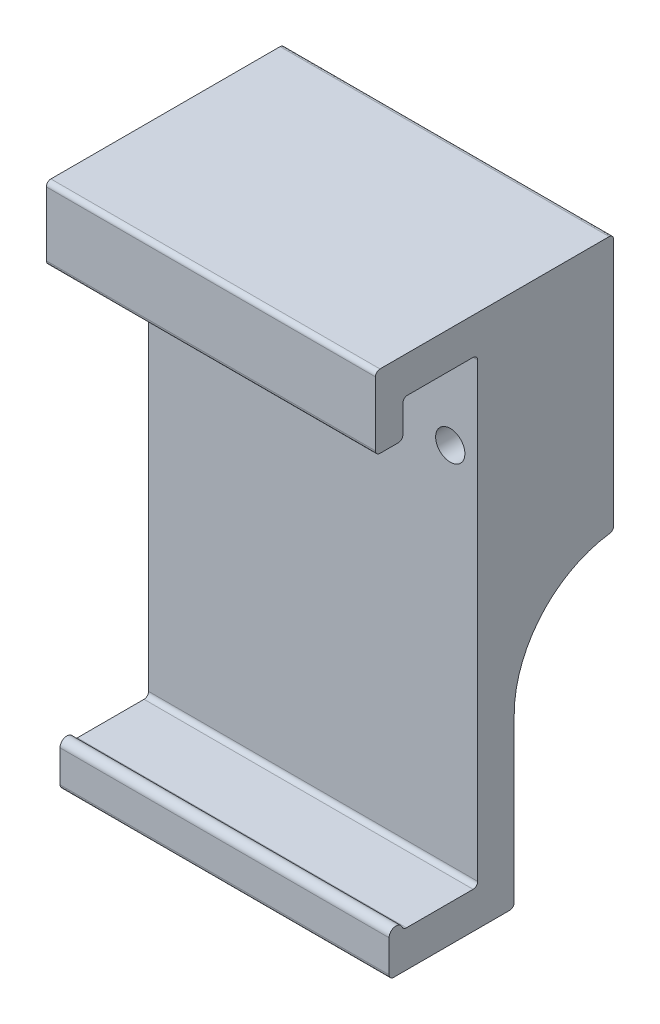
ISO-10303-21;
HEADER;
FILE_DESCRIPTION(('STEP AP214'),'2;1');
FILE_NAME('part.step','',(''),(''),'','','');
FILE_SCHEMA(('AUTOMOTIVE_DESIGN { 1 0 10303 214 1 1 1 1 }'));
ENDSEC;
DATA;
#1=APPLICATION_CONTEXT('core data for automotive mechanical design processes');
#2=APPLICATION_PROTOCOL_DEFINITION('international standard','automotive_design',2000,#1);
#3=PRODUCT_CONTEXT('',#1,'mechanical');
#4=PRODUCT('Part','Part','',(#3));
#5=PRODUCT_RELATED_PRODUCT_CATEGORY('part','',(#4));
#6=PRODUCT_DEFINITION_FORMATION('','',#4);
#7=PRODUCT_DEFINITION_CONTEXT('part definition',#1,'design');
#8=PRODUCT_DEFINITION('design','',#6,#7);
#9=PRODUCT_DEFINITION_SHAPE('','',#8);
#10=(LENGTH_UNIT() NAMED_UNIT(*) SI_UNIT(.MILLI.,.METRE.));
#11=(NAMED_UNIT(*) PLANE_ANGLE_UNIT() SI_UNIT($,.RADIAN.));
#12=(NAMED_UNIT(*) SI_UNIT($,.STERADIAN.) SOLID_ANGLE_UNIT());
#13=UNCERTAINTY_MEASURE_WITH_UNIT(LENGTH_MEASURE(1.E-05),#10,'distance_accuracy_value','');
#14=(GEOMETRIC_REPRESENTATION_CONTEXT(3) GLOBAL_UNCERTAINTY_ASSIGNED_CONTEXT((#13)) GLOBAL_UNIT_ASSIGNED_CONTEXT((#10,
#11,#12)) REPRESENTATION_CONTEXT('',''));
#15=CARTESIAN_POINT('',(0.,0.,0.));
#16=DIRECTION('',(0.,0.,1.));
#17=DIRECTION('',(1.,0.,0.));
#18=AXIS2_PLACEMENT_3D('',#15,#16,#17);
#19=CARTESIAN_POINT('',(14.2875,23.175,-6.425));
#20=DIRECTION('',(0.,0.,1.));
#21=DIRECTION('',(0.,-1.,0.));
#22=AXIS2_PLACEMENT_3D('',#19,#20,#21);
#23=PLANE('',#22);
#24=DIRECTION('',(0.,1.,0.));
#25=VECTOR('',#24,1.);
#26=CARTESIAN_POINT('',(-14.2875,23.175,-6.425));
#27=LINE('',#26,#25);
#28=CARTESIAN_POINT('',(-14.2875,-22.778125,-6.425));
#29=VERTEX_POINT('',#28);
#30=CARTESIAN_POINT('',(-14.2875,-8.61832244668706,-6.425));
#31=VERTEX_POINT('',#30);
#32=EDGE_CURVE('E261',#29,#31,#27,.T.);
#33=ORIENTED_EDGE('',*,*,#32,.T.);
#34=DIRECTION('',(-1.,0.,0.));
#35=VECTOR('',#34,1.);
#36=CARTESIAN_POINT('',(14.2875,-8.61832244668706,-6.425));
#37=LINE('',#36,#35);
#38=CARTESIAN_POINT('',(14.2875,-8.61832244668706,-6.425));
#39=VERTEX_POINT('',#38);
#40=EDGE_CURVE('E58',#31,#39,#37,.F.);
#41=ORIENTED_EDGE('',*,*,#40,.T.);
#42=DIRECTION('',(0.,1.,0.));
#43=VECTOR('',#42,1.);
#44=CARTESIAN_POINT('',(14.2875,23.175,-6.425));
#45=LINE('',#44,#43);
#46=CARTESIAN_POINT('',(14.2875,-22.778125,-6.425));
#47=VERTEX_POINT('',#46);
#48=EDGE_CURVE('E230',#47,#39,#45,.T.);
#49=ORIENTED_EDGE('',*,*,#48,.F.);
#50=DIRECTION('',(-1.,0.,0.));
#51=VECTOR('',#50,1.);
#52=CARTESIAN_POINT('',(14.2875,-22.778125,-6.425));
#53=LINE('',#52,#51);
#54=EDGE_CURVE('E374',#47,#29,#53,.T.);
#55=ORIENTED_EDGE('',*,*,#54,.T.);
#56=EDGE_LOOP('',(#33,#41,#49,#55));
#57=FACE_BOUND('',#56,.T.);
#58=ADVANCED_FACE('F37',(#57),#23,.F.);
#59=CARTESIAN_POINT('',(14.2875,20.,-3.25));
#60=DIRECTION('',(0.,0.,-1.));
#61=DIRECTION('',(-1.,0.,0.));
#62=AXIS2_PLACEMENT_3D('',#59,#60,#61);
#63=PLANE('',#62);
#64=CARTESIAN_POINT('',(11.90625,11.999,-3.25));
#65=DIRECTION('',(0.,0.,-1.));
#66=DIRECTION('',(-1.,0.,0.));
#67=AXIS2_PLACEMENT_3D('',#64,#65,#66);
#68=CIRCLE('',#67,1.27);
#69=CARTESIAN_POINT('',(10.63625,11.999,-3.25));
#70=VERTEX_POINT('',#69);
#71=EDGE_CURVE('E396',#70,#70,#68,.T.);
#72=ORIENTED_EDGE('',*,*,#71,.T.);
#73=EDGE_LOOP('',(#72));
#74=FACE_BOUND('',#73,.T.);
#75=CARTESIAN_POINT('',(-11.90625,11.9990000000001,-3.25));
#76=DIRECTION('',(0.,0.,-1.));
#77=DIRECTION('',(-1.,0.,0.));
#78=AXIS2_PLACEMENT_3D('',#75,#76,#77);
#79=CIRCLE('',#78,1.27);
#80=CARTESIAN_POINT('',(-13.17625,11.9990000000001,-3.25));
#81=VERTEX_POINT('',#80);
#82=EDGE_CURVE('E400',#81,#81,#79,.T.);
#83=ORIENTED_EDGE('',*,*,#82,.T.);
#84=EDGE_LOOP('',(#83));
#85=FACE_BOUND('',#84,.T.);
#86=DIRECTION('',(0.,-1.,0.));
#87=VECTOR('',#86,1.);
#88=CARTESIAN_POINT('',(14.2875,20.,-3.25));
#89=LINE('',#88,#87);
#90=CARTESIAN_POINT('',(14.2875,19.603125,-3.25));
#91=VERTEX_POINT('',#90);
#92=CARTESIAN_POINT('',(14.2875,-19.603125,-3.25));
#93=VERTEX_POINT('',#92);
#94=EDGE_CURVE('E276',#91,#93,#89,.T.);
#95=ORIENTED_EDGE('',*,*,#94,.F.);
#96=DIRECTION('',(-1.,0.,0.));
#97=VECTOR('',#96,1.);
#98=CARTESIAN_POINT('',(-14.2875,19.603125,-3.25));
#99=LINE('',#98,#97);
#100=CARTESIAN_POINT('',(-14.2875,19.603125,-3.25));
#101=VERTEX_POINT('',#100);
#102=EDGE_CURVE('E318',#91,#101,#99,.T.);
#103=ORIENTED_EDGE('',*,*,#102,.T.);
#104=DIRECTION('',(0.,-1.,0.));
#105=VECTOR('',#104,1.);
#106=CARTESIAN_POINT('',(-14.2875,20.,-3.25));
#107=LINE('',#106,#105);
#108=CARTESIAN_POINT('',(-14.2875,-19.603125,-3.25));
#109=VERTEX_POINT('',#108);
#110=EDGE_CURVE('E248',#101,#109,#107,.T.);
#111=ORIENTED_EDGE('',*,*,#110,.T.);
#112=DIRECTION('',(-1.,0.,0.));
#113=VECTOR('',#112,1.);
#114=CARTESIAN_POINT('',(14.2875,-19.603125,-3.25));
#115=LINE('',#114,#113);
#116=EDGE_CURVE('E316',#109,#93,#115,.F.);
#117=ORIENTED_EDGE('',*,*,#116,.T.);
#118=EDGE_LOOP('',(#95,#103,#111,#117));
#119=FACE_BOUND('',#118,.T.);
#120=ADVANCED_FACE('F476',(#74,#85,#119),#63,.F.);
#121=CARTESIAN_POINT('',(14.2875,-20.,-3.25));
#122=DIRECTION('',(0.,-1.,0.));
#123=DIRECTION('',(0.,0.,-1.));
#124=AXIS2_PLACEMENT_3D('',#121,#122,#123);
#125=PLANE('',#124);
#126=DIRECTION('',(0.,0.,1.));
#127=VECTOR('',#126,1.);
#128=CARTESIAN_POINT('',(14.2875,-20.,-3.25));
#129=LINE('',#128,#127);
#130=CARTESIAN_POINT('',(14.2875,-20.,-2.853125));
#131=VERTEX_POINT('',#130);
#132=CARTESIAN_POINT('',(14.2875,-20.,2.9359576355322));
#133=VERTEX_POINT('',#132);
#134=EDGE_CURVE('E211',#131,#133,#129,.T.);
#135=ORIENTED_EDGE('',*,*,#134,.F.);
#136=DIRECTION('',(-1.,0.,0.));
#137=VECTOR('',#136,1.);
#138=CARTESIAN_POINT('',(-14.2875,-20.,-2.853125));
#139=LINE('',#138,#137);
#140=CARTESIAN_POINT('',(-14.2875,-20.,-2.853125));
#141=VERTEX_POINT('',#140);
#142=EDGE_CURVE('E328',#131,#141,#139,.T.);
#143=ORIENTED_EDGE('',*,*,#142,.T.);
#144=DIRECTION('',(0.,0.,1.));
#145=VECTOR('',#144,1.);
#146=CARTESIAN_POINT('',(-14.2875,-20.,-3.25));
#147=LINE('',#146,#145);
#148=CARTESIAN_POINT('',(-14.2875,-20.,2.9359576355322));
#149=VERTEX_POINT('',#148);
#150=EDGE_CURVE('E251',#141,#149,#147,.T.);
#151=ORIENTED_EDGE('',*,*,#150,.T.);
#152=DIRECTION('',(1.,0.,0.));
#153=VECTOR('',#152,1.);
#154=CARTESIAN_POINT('',(14.2875,-20.,2.9359576355322));
#155=LINE('',#154,#153);
#156=EDGE_CURVE('E326',#149,#133,#155,.T.);
#157=ORIENTED_EDGE('',*,*,#156,.T.);
#158=EDGE_LOOP('',(#135,#143,#151,#157));
#159=FACE_BOUND('',#158,.T.);
#160=ADVANCED_FACE('F481',(#159),#125,.F.);
#161=CARTESIAN_POINT('',(14.2875,-20.,3.8453125));
#162=DIRECTION('',(-1.,0.,0.));
#163=DIRECTION('',(0.,0.,1.));
#164=AXIS2_PLACEMENT_3D('',#161,#162,#163);
#165=CYLINDRICAL_SURFACE('',#164,0.595312500000001);
#166=CARTESIAN_POINT('',(14.2875,-20.,3.8453125));
#167=DIRECTION('',(1.,0.,0.));
#168=DIRECTION('',(0.,0.,-1.));
#169=AXIS2_PLACEMENT_3D('',#166,#167,#168);
#170=CIRCLE('',#169,0.595312500000001);
#171=CARTESIAN_POINT('',(14.2875,-19.761875,3.29969958131932));
#172=VERTEX_POINT('',#171);
#173=CARTESIAN_POINT('',(14.2875,-20.,4.440625));
#174=VERTEX_POINT('',#173);
#175=EDGE_CURVE('E198',#172,#174,#170,.T.);
#176=ORIENTED_EDGE('',*,*,#175,.F.);
#177=DIRECTION('',(-1.,0.,0.));
#178=VECTOR('',#177,1.);
#179=CARTESIAN_POINT('',(14.2875,-19.761875,3.29969958131932));
#180=LINE('',#179,#178);
#181=CARTESIAN_POINT('',(-14.2875,-19.761875,3.29969958131932));
#182=VERTEX_POINT('',#181);
#183=EDGE_CURVE('E331',#172,#182,#180,.T.);
#184=ORIENTED_EDGE('',*,*,#183,.T.);
#185=CARTESIAN_POINT('',(-14.2875,-20.,3.8453125));
#186=DIRECTION('',(1.,0.,0.));
#187=DIRECTION('',(0.,0.,-1.));
#188=AXIS2_PLACEMENT_3D('',#185,#186,#187);
#189=CIRCLE('',#188,0.595312500000001);
#190=CARTESIAN_POINT('',(-14.2875,-20.,4.440625));
#191=VERTEX_POINT('',#190);
#192=EDGE_CURVE('E217',#182,#191,#189,.T.);
#193=ORIENTED_EDGE('',*,*,#192,.T.);
#194=DIRECTION('',(-1.,0.,0.));
#195=VECTOR('',#194,1.);
#196=CARTESIAN_POINT('',(14.2875,-20.,4.440625));
#197=LINE('',#196,#195);
#198=EDGE_CURVE('E214',#174,#191,#197,.T.);
#199=ORIENTED_EDGE('',*,*,#198,.F.);
#200=EDGE_LOOP('',(#176,#184,#193,#199));
#201=FACE_BOUND('',#200,.T.);
#202=ADVANCED_FACE('F215',(#201),#165,.T.);
#203=CARTESIAN_POINT('',(14.2875,-23.175,4.440625));
#204=DIRECTION('',(0.,0.,-1.));
#205=DIRECTION('',(0.,1.,0.));
#206=AXIS2_PLACEMENT_3D('',#203,#204,#205);
#207=PLANE('',#206);
#208=DIRECTION('',(0.,-1.,0.));
#209=VECTOR('',#208,1.);
#210=CARTESIAN_POINT('',(-14.2875,-23.175,4.440625));
#211=LINE('',#210,#209);
#212=CARTESIAN_POINT('',(-14.2875,-22.778125,4.440625));
#213=VERTEX_POINT('',#212);
#214=EDGE_CURVE('E256',#191,#213,#211,.T.);
#215=ORIENTED_EDGE('',*,*,#214,.T.);
#216=DIRECTION('',(-1.,0.,0.));
#217=VECTOR('',#216,1.);
#218=CARTESIAN_POINT('',(14.2875,-22.778125,4.440625));
#219=LINE('',#218,#217);
#220=CARTESIAN_POINT('',(14.2875,-22.778125,4.440625));
#221=VERTEX_POINT('',#220);
#222=EDGE_CURVE('E226',#213,#221,#219,.F.);
#223=ORIENTED_EDGE('',*,*,#222,.T.);
#224=DIRECTION('',(0.,-1.,0.));
#225=VECTOR('',#224,1.);
#226=CARTESIAN_POINT('',(14.2875,-23.175,4.440625));
#227=LINE('',#226,#225);
#228=EDGE_CURVE('E203',#174,#221,#227,.T.);
#229=ORIENTED_EDGE('',*,*,#228,.F.);
#230=ORIENTED_EDGE('',*,*,#198,.T.);
#231=EDGE_LOOP('',(#215,#223,#229,#230));
#232=FACE_BOUND('',#231,.T.);
#233=ADVANCED_FACE('F224',(#232),#207,.F.);
#234=CARTESIAN_POINT('',(14.2875,-23.175,-6.425));
#235=DIRECTION('',(0.,1.,0.));
#236=DIRECTION('',(0.,0.,1.));
#237=AXIS2_PLACEMENT_3D('',#234,#235,#236);
#238=PLANE('',#237);
#239=DIRECTION('',(0.,0.,-1.));
#240=VECTOR('',#239,1.);
#241=CARTESIAN_POINT('',(-14.2875,-23.175,-6.425));
#242=LINE('',#241,#240);
#243=CARTESIAN_POINT('',(-14.2875,-23.175,4.04375));
#244=VERTEX_POINT('',#243);
#245=CARTESIAN_POINT('',(-14.2875,-23.175,-6.028125));
#246=VERTEX_POINT('',#245);
#247=EDGE_CURVE('E258',#244,#246,#242,.T.);
#248=ORIENTED_EDGE('',*,*,#247,.T.);
#249=DIRECTION('',(-1.,0.,0.));
#250=VECTOR('',#249,1.);
#251=CARTESIAN_POINT('',(14.2875,-23.175,-6.028125));
#252=LINE('',#251,#250);
#253=CARTESIAN_POINT('',(14.2875,-23.175,-6.028125));
#254=VERTEX_POINT('',#253);
#255=EDGE_CURVE('E377',#246,#254,#252,.F.);
#256=ORIENTED_EDGE('',*,*,#255,.T.);
#257=DIRECTION('',(0.,0.,-1.));
#258=VECTOR('',#257,1.);
#259=CARTESIAN_POINT('',(14.2875,-23.175,-6.425));
#260=LINE('',#259,#258);
#261=CARTESIAN_POINT('',(14.2875,-23.175,4.04375));
#262=VERTEX_POINT('',#261);
#263=EDGE_CURVE('E227',#262,#254,#260,.T.);
#264=ORIENTED_EDGE('',*,*,#263,.F.);
#265=DIRECTION('',(-1.,0.,0.));
#266=VECTOR('',#265,1.);
#267=CARTESIAN_POINT('',(14.2875,-23.175,4.04375));
#268=LINE('',#267,#266);
#269=EDGE_CURVE('E312',#262,#244,#268,.T.);
#270=ORIENTED_EDGE('',*,*,#269,.T.);
#271=EDGE_LOOP('',(#248,#256,#264,#270));
#272=FACE_BOUND('',#271,.T.);
#273=ADVANCED_FACE('F419',(#272),#238,.F.);
#274=CARTESIAN_POINT('',(14.2875,23.175,5.63125));
#275=DIRECTION('',(0.,-1.,0.));
#276=DIRECTION('',(0.,0.,-1.));
#277=AXIS2_PLACEMENT_3D('',#274,#275,#276);
#278=PLANE('',#277);
#279=DIRECTION('',(0.,0.,1.));
#280=VECTOR('',#279,1.);
#281=CARTESIAN_POINT('',(14.2875,23.175,5.63125));
#282=LINE('',#281,#280);
#283=CARTESIAN_POINT('',(14.2875,23.175,-14.664125));
#284=VERTEX_POINT('',#283);
#285=CARTESIAN_POINT('',(14.2875,23.175,5.234375));
#286=VERTEX_POINT('',#285);
#287=EDGE_CURVE('E235',#284,#286,#282,.T.);
#288=ORIENTED_EDGE('',*,*,#287,.F.);
#289=DIRECTION('',(-1.,0.,0.));
#290=VECTOR('',#289,1.);
#291=CARTESIAN_POINT('',(14.2875,23.175,-14.664125));
#292=LINE('',#291,#290);
#293=CARTESIAN_POINT('',(-14.2875,23.175,-14.664125));
#294=VERTEX_POINT('',#293);
#295=EDGE_CURVE('E359',#284,#294,#292,.T.);
#296=ORIENTED_EDGE('',*,*,#295,.T.);
#297=DIRECTION('',(0.,0.,1.));
#298=VECTOR('',#297,1.);
#299=CARTESIAN_POINT('',(-14.2875,23.175,5.63125));
#300=LINE('',#299,#298);
#301=CARTESIAN_POINT('',(-14.2875,23.175,5.234375));
#302=VERTEX_POINT('',#301);
#303=EDGE_CURVE('E263',#294,#302,#300,.T.);
#304=ORIENTED_EDGE('',*,*,#303,.T.);
#305=DIRECTION('',(-1.,0.,0.));
#306=VECTOR('',#305,1.);
#307=CARTESIAN_POINT('',(14.2875,23.175,5.234375));
#308=LINE('',#307,#306);
#309=EDGE_CURVE('E309',#302,#286,#308,.F.);
#310=ORIENTED_EDGE('',*,*,#309,.T.);
#311=EDGE_LOOP('',(#288,#296,#304,#310));
#312=FACE_BOUND('',#311,.T.);
#313=ADVANCED_FACE('F432',(#312),#278,.F.);
#314=CARTESIAN_POINT('',(14.2875,16.825,5.63125));
#315=DIRECTION('',(0.,0.,-1.));
#316=DIRECTION('',(-1.,0.,0.));
#317=AXIS2_PLACEMENT_3D('',#314,#315,#316);
#318=PLANE('',#317);
#319=DIRECTION('',(0.,-1.,0.));
#320=VECTOR('',#319,1.);
#321=CARTESIAN_POINT('',(-14.2875,16.825,5.63125));
#322=LINE('',#321,#320);
#323=CARTESIAN_POINT('',(-14.2875,22.778125,5.63125));
#324=VERTEX_POINT('',#323);
#325=CARTESIAN_POINT('',(-14.2875,17.221875,5.63125));
#326=VERTEX_POINT('',#325);
#327=EDGE_CURVE('E265',#324,#326,#322,.T.);
#328=ORIENTED_EDGE('',*,*,#327,.T.);
#329=DIRECTION('',(-1.,0.,0.));
#330=VECTOR('',#329,1.);
#331=CARTESIAN_POINT('',(14.2875,17.221875,5.63125));
#332=LINE('',#331,#330);
#333=CARTESIAN_POINT('',(14.2875,17.221875,5.63125));
#334=VERTEX_POINT('',#333);
#335=EDGE_CURVE('E307',#326,#334,#332,.F.);
#336=ORIENTED_EDGE('',*,*,#335,.T.);
#337=DIRECTION('',(0.,-1.,0.));
#338=VECTOR('',#337,1.);
#339=CARTESIAN_POINT('',(14.2875,16.825,5.63125));
#340=LINE('',#339,#338);
#341=CARTESIAN_POINT('',(14.2875,22.778125,5.63125));
#342=VERTEX_POINT('',#341);
#343=EDGE_CURVE('E237',#342,#334,#340,.T.);
#344=ORIENTED_EDGE('',*,*,#343,.F.);
#345=DIRECTION('',(-1.,0.,0.));
#346=VECTOR('',#345,1.);
#347=CARTESIAN_POINT('',(14.2875,22.778125,5.63125));
#348=LINE('',#347,#346);
#349=EDGE_CURVE('E304',#342,#324,#348,.T.);
#350=ORIENTED_EDGE('',*,*,#349,.T.);
#351=EDGE_LOOP('',(#328,#336,#344,#350));
#352=FACE_BOUND('',#351,.T.);
#353=ADVANCED_FACE('F441',(#352),#318,.F.);
#354=CARTESIAN_POINT('',(14.2875,16.825,3.25));
#355=DIRECTION('',(0.,1.,0.));
#356=DIRECTION('',(0.,0.,1.));
#357=AXIS2_PLACEMENT_3D('',#354,#355,#356);
#358=PLANE('',#357);
#359=DIRECTION('',(0.,0.,-1.));
#360=VECTOR('',#359,1.);
#361=CARTESIAN_POINT('',(-14.2875,16.825,3.25));
#362=LINE('',#361,#360);
#363=CARTESIAN_POINT('',(-14.2875,16.825,5.234375));
#364=VERTEX_POINT('',#363);
#365=CARTESIAN_POINT('',(-14.2875,16.825,3.646875));
#366=VERTEX_POINT('',#365);
#367=EDGE_CURVE('E268',#364,#366,#362,.T.);
#368=ORIENTED_EDGE('',*,*,#367,.T.);
#369=DIRECTION('',(-1.,0.,0.));
#370=VECTOR('',#369,1.);
#371=CARTESIAN_POINT('',(14.2875,16.825,3.646875));
#372=LINE('',#371,#370);
#373=CARTESIAN_POINT('',(14.2875,16.825,3.646875));
#374=VERTEX_POINT('',#373);
#375=EDGE_CURVE('E294',#366,#374,#372,.F.);
#376=ORIENTED_EDGE('',*,*,#375,.T.);
#377=DIRECTION('',(0.,0.,-1.));
#378=VECTOR('',#377,1.);
#379=CARTESIAN_POINT('',(14.2875,16.825,3.25));
#380=LINE('',#379,#378);
#381=CARTESIAN_POINT('',(14.2875,16.825,5.234375));
#382=VERTEX_POINT('',#381);
#383=EDGE_CURVE('E240',#382,#374,#380,.T.);
#384=ORIENTED_EDGE('',*,*,#383,.F.);
#385=DIRECTION('',(-1.,0.,0.));
#386=VECTOR('',#385,1.);
#387=CARTESIAN_POINT('',(14.2875,16.825,5.234375));
#388=LINE('',#387,#386);
#389=EDGE_CURVE('E291',#382,#364,#388,.T.);
#390=ORIENTED_EDGE('',*,*,#389,.T.);
#391=EDGE_LOOP('',(#368,#376,#384,#390));
#392=FACE_BOUND('',#391,.T.);
#393=ADVANCED_FACE('F450',(#392),#358,.F.);
#394=CARTESIAN_POINT('',(14.2875,16.825,3.25));
#395=DIRECTION('',(0.,0.,1.));
#396=DIRECTION('',(0.,-1.,0.));
#397=AXIS2_PLACEMENT_3D('',#394,#395,#396);
#398=PLANE('',#397);
#399=DIRECTION('',(0.,1.,0.));
#400=VECTOR('',#399,1.);
#401=CARTESIAN_POINT('',(14.2875,16.825,3.25));
#402=LINE('',#401,#400);
#403=CARTESIAN_POINT('',(14.2875,17.221875,3.25));
#404=VERTEX_POINT('',#403);
#405=CARTESIAN_POINT('',(14.2875,19.603125,3.25));
#406=VERTEX_POINT('',#405);
#407=EDGE_CURVE('E243',#404,#406,#402,.T.);
#408=ORIENTED_EDGE('',*,*,#407,.F.);
#409=DIRECTION('',(-1.,0.,0.));
#410=VECTOR('',#409,1.);
#411=CARTESIAN_POINT('',(14.2875,17.221875,3.25));
#412=LINE('',#411,#410);
#413=CARTESIAN_POINT('',(-14.2875,17.221875,3.25));
#414=VERTEX_POINT('',#413);
#415=EDGE_CURVE('E279',#404,#414,#412,.T.);
#416=ORIENTED_EDGE('',*,*,#415,.T.);
#417=DIRECTION('',(0.,1.,0.));
#418=VECTOR('',#417,1.);
#419=CARTESIAN_POINT('',(-14.2875,16.825,3.25));
#420=LINE('',#419,#418);
#421=CARTESIAN_POINT('',(-14.2875,19.603125,3.25));
#422=VERTEX_POINT('',#421);
#423=EDGE_CURVE('E271',#414,#422,#420,.T.);
#424=ORIENTED_EDGE('',*,*,#423,.T.);
#425=DIRECTION('',(-1.,0.,0.));
#426=VECTOR('',#425,1.);
#427=CARTESIAN_POINT('',(14.2875,19.603125,3.25));
#428=LINE('',#427,#426);
#429=EDGE_CURVE('E221',#422,#406,#428,.F.);
#430=ORIENTED_EDGE('',*,*,#429,.T.);
#431=EDGE_LOOP('',(#408,#416,#424,#430));
#432=FACE_BOUND('',#431,.T.);
#433=ADVANCED_FACE('F459',(#432),#398,.F.);
#434=CARTESIAN_POINT('',(14.2875,20.,3.25));
#435=DIRECTION('',(0.,1.,0.));
#436=DIRECTION('',(0.,0.,1.));
#437=AXIS2_PLACEMENT_3D('',#434,#435,#436);
#438=PLANE('',#437);
#439=DIRECTION('',(0.,0.,-1.));
#440=VECTOR('',#439,1.);
#441=CARTESIAN_POINT('',(-14.2875,20.,3.25));
#442=LINE('',#441,#440);
#443=CARTESIAN_POINT('',(-14.2875,20.,2.853125));
#444=VERTEX_POINT('',#443);
#445=CARTESIAN_POINT('',(-14.2875,20.,-2.853125));
#446=VERTEX_POINT('',#445);
#447=EDGE_CURVE('E274',#444,#446,#442,.T.);
#448=ORIENTED_EDGE('',*,*,#447,.T.);
#449=DIRECTION('',(-1.,0.,0.));
#450=VECTOR('',#449,1.);
#451=CARTESIAN_POINT('',(14.2875,20.,-2.853125));
#452=LINE('',#451,#450);
#453=CARTESIAN_POINT('',(14.2875,20.,-2.853125));
#454=VERTEX_POINT('',#453);
#455=EDGE_CURVE('E324',#446,#454,#452,.F.);
#456=ORIENTED_EDGE('',*,*,#455,.T.);
#457=DIRECTION('',(0.,0.,-1.));
#458=VECTOR('',#457,1.);
#459=CARTESIAN_POINT('',(14.2875,20.,3.25));
#460=LINE('',#459,#458);
#461=CARTESIAN_POINT('',(14.2875,20.,2.853125));
#462=VERTEX_POINT('',#461);
#463=EDGE_CURVE('E222',#462,#454,#460,.T.);
#464=ORIENTED_EDGE('',*,*,#463,.F.);
#465=DIRECTION('',(-1.,0.,0.));
#466=VECTOR('',#465,1.);
#467=CARTESIAN_POINT('',(-14.2875,20.,2.853125));
#468=LINE('',#467,#466);
#469=EDGE_CURVE('E321',#462,#444,#468,.T.);
#470=ORIENTED_EDGE('',*,*,#469,.T.);
#471=EDGE_LOOP('',(#448,#456,#464,#470));
#472=FACE_BOUND('',#471,.T.);
#473=ADVANCED_FACE('F468',(#472),#438,.F.);
#474=CARTESIAN_POINT('',(14.2875,-20.,3.8453125));
#475=DIRECTION('',(1.,0.,0.));
#476=DIRECTION('',(0.,0.,-1.));
#477=AXIS2_PLACEMENT_3D('',#474,#475,#476);
#478=PLANE('',#477);
#479=DIRECTION('',(0.,1.,0.));
#480=VECTOR('',#479,1.);
#481=CARTESIAN_POINT('',(14.2875,20.635,-15.061));
#482=LINE('',#481,#480);
#483=CARTESIAN_POINT('',(14.2875,1.21987500000001,-15.061));
#484=VERTEX_POINT('',#483);
#485=CARTESIAN_POINT('',(14.2875,22.778125,-15.061));
#486=VERTEX_POINT('',#485);
#487=EDGE_CURVE('E252',#484,#486,#482,.T.);
#488=ORIENTED_EDGE('',*,*,#487,.T.);
#489=CARTESIAN_POINT('',(14.2875,22.778125,-14.664125));
#490=DIRECTION('',(1.,0.,0.));
#491=DIRECTION('',(0.,0.,-1.));
#492=AXIS2_PLACEMENT_3D('',#489,#490,#491);
#493=CIRCLE('',#492,0.396875);
#494=EDGE_CURVE('E372',#486,#284,#493,.T.);
#495=ORIENTED_EDGE('',*,*,#494,.T.);
#496=ORIENTED_EDGE('',*,*,#287,.T.);
#497=CARTESIAN_POINT('',(14.2875,22.778125,5.234375));
#498=DIRECTION('',(1.,0.,0.));
#499=DIRECTION('',(0.,0.,-1.));
#500=AXIS2_PLACEMENT_3D('',#497,#498,#499);
#501=CIRCLE('',#500,0.396875);
#502=EDGE_CURVE('E298',#286,#342,#501,.T.);
#503=ORIENTED_EDGE('',*,*,#502,.T.);
#504=ORIENTED_EDGE('',*,*,#343,.T.);
#505=CARTESIAN_POINT('',(14.2875,17.221875,5.234375));
#506=DIRECTION('',(1.,0.,0.));
#507=DIRECTION('',(0.,0.,-1.));
#508=AXIS2_PLACEMENT_3D('',#505,#506,#507);
#509=CIRCLE('',#508,0.396875);
#510=EDGE_CURVE('E300',#334,#382,#509,.T.);
#511=ORIENTED_EDGE('',*,*,#510,.T.);
#512=ORIENTED_EDGE('',*,*,#383,.T.);
#513=CARTESIAN_POINT('',(14.2875,17.221875,3.646875));
#514=DIRECTION('',(1.,0.,0.));
#515=DIRECTION('',(0.,0.,-1.));
#516=AXIS2_PLACEMENT_3D('',#513,#514,#515);
#517=CIRCLE('',#516,0.396875);
#518=EDGE_CURVE('E302',#374,#404,#517,.T.);
#519=ORIENTED_EDGE('',*,*,#518,.T.);
#520=ORIENTED_EDGE('',*,*,#407,.T.);
#521=CARTESIAN_POINT('',(14.2875,19.603125,2.853125));
#522=DIRECTION('',(1.,0.,0.));
#523=DIRECTION('',(0.,0.,-1.));
#524=AXIS2_PLACEMENT_3D('',#521,#522,#523);
#525=CIRCLE('',#524,0.396875);
#526=EDGE_CURVE('E339',#406,#462,#525,.F.);
#527=ORIENTED_EDGE('',*,*,#526,.T.);
#528=ORIENTED_EDGE('',*,*,#463,.T.);
#529=CARTESIAN_POINT('',(14.2875,19.603125,-2.853125));
#530=DIRECTION('',(1.,0.,0.));
#531=DIRECTION('',(0.,0.,-1.));
#532=AXIS2_PLACEMENT_3D('',#529,#530,#531);
#533=CIRCLE('',#532,0.396875);
#534=EDGE_CURVE('E335',#454,#91,#533,.F.);
#535=ORIENTED_EDGE('',*,*,#534,.T.);
#536=ORIENTED_EDGE('',*,*,#94,.T.);
#537=CARTESIAN_POINT('',(14.2875,-19.603125,-2.853125));
#538=DIRECTION('',(1.,0.,0.));
#539=DIRECTION('',(0.,0.,-1.));
#540=AXIS2_PLACEMENT_3D('',#537,#538,#539);
#541=CIRCLE('',#540,0.396875);
#542=EDGE_CURVE('E343',#93,#131,#541,.F.);
#543=ORIENTED_EDGE('',*,*,#542,.T.);
#544=ORIENTED_EDGE('',*,*,#134,.T.);
#545=CARTESIAN_POINT('',(14.2875,-19.603125,2.9359576355322));
#546=DIRECTION('',(1.,0.,0.));
#547=DIRECTION('',(0.,0.,-1.));
#548=AXIS2_PLACEMENT_3D('',#545,#546,#547);
#549=CIRCLE('',#548,0.396875);
#550=EDGE_CURVE('E207',#133,#172,#549,.F.);
#551=ORIENTED_EDGE('',*,*,#550,.T.);
#552=ORIENTED_EDGE('',*,*,#175,.T.);
#553=ORIENTED_EDGE('',*,*,#228,.T.);
#554=CARTESIAN_POINT('',(14.2875,-22.778125,4.04375));
#555=DIRECTION('',(1.,0.,0.));
#556=DIRECTION('',(0.,0.,-1.));
#557=AXIS2_PLACEMENT_3D('',#554,#555,#556);
#558=CIRCLE('',#557,0.396875);
#559=EDGE_CURVE('E296',#221,#262,#558,.T.);
#560=ORIENTED_EDGE('',*,*,#559,.T.);
#561=ORIENTED_EDGE('',*,*,#263,.T.);
#562=CARTESIAN_POINT('',(14.2875,-22.778125,-6.028125));
#563=DIRECTION('',(1.,0.,0.));
#564=DIRECTION('',(0.,0.,-1.));
#565=AXIS2_PLACEMENT_3D('',#562,#563,#564);
#566=CIRCLE('',#565,0.396875);
#567=EDGE_CURVE('E368',#254,#47,#566,.T.);
#568=ORIENTED_EDGE('',*,*,#567,.T.);
#569=ORIENTED_EDGE('',*,*,#48,.T.);
#570=CARTESIAN_POINT('',(14.2875,-8.61832244668707,-15.95));
#571=DIRECTION('',(1.,0.,0.));
#572=DIRECTION('',(0.,0.,-1.));
#573=AXIS2_PLACEMENT_3D('',#570,#571,#572);
#574=CIRCLE('',#573,9.525);
#575=CARTESIAN_POINT('',(14.2875,0.826347102132523,-14.71556));
#576=VERTEX_POINT('',#575);
#577=EDGE_CURVE('E11',#39,#576,#574,.F.);
#578=ORIENTED_EDGE('',*,*,#577,.T.);
#579=CARTESIAN_POINT('',(14.2875,1.21987500000001,-14.664125));
#580=DIRECTION('',(1.,0.,0.));
#581=DIRECTION('',(0.,0.,-1.));
#582=AXIS2_PLACEMENT_3D('',#579,#580,#581);
#583=CIRCLE('',#582,0.396875);
#584=EDGE_CURVE('E370',#576,#484,#583,.T.);
#585=ORIENTED_EDGE('',*,*,#584,.T.);
#586=EDGE_LOOP('',(#488,#495,#496,#503,#504,#511,#512,#519,#520,#527,#528,#535,#536,#543,#544,
#551,#552,#553,#560,#561,#568,#569,#578,#585));
#587=FACE_BOUND('',#586,.T.);
#588=ADVANCED_FACE('F201',(#587),#478,.T.);
#589=CARTESIAN_POINT('',(-14.2875,-20.,3.8453125));
#590=DIRECTION('',(1.,0.,0.));
#591=DIRECTION('',(0.,0.,-1.));
#592=AXIS2_PLACEMENT_3D('',#589,#590,#591);
#593=PLANE('',#592);
#594=ORIENTED_EDGE('',*,*,#303,.F.);
#595=CARTESIAN_POINT('',(-14.2875,22.778125,-14.664125));
#596=DIRECTION('',(1.,0.,0.));
#597=DIRECTION('',(0.,0.,-1.));
#598=AXIS2_PLACEMENT_3D('',#595,#596,#597);
#599=CIRCLE('',#598,0.396875);
#600=CARTESIAN_POINT('',(-14.2875,22.778125,-15.061));
#601=VERTEX_POINT('',#600);
#602=EDGE_CURVE('E366',#294,#601,#599,.F.);
#603=ORIENTED_EDGE('',*,*,#602,.T.);
#604=DIRECTION('',(0.,1.,0.));
#605=VECTOR('',#604,1.);
#606=CARTESIAN_POINT('',(-14.2875,3.36300000000001,-15.061));
#607=LINE('',#606,#605);
#608=CARTESIAN_POINT('',(-14.2875,1.21987500000001,-15.061));
#609=VERTEX_POINT('',#608);
#610=EDGE_CURVE('E393',#609,#601,#607,.T.);
#611=ORIENTED_EDGE('',*,*,#610,.F.);
#612=CARTESIAN_POINT('',(-14.2875,1.21987500000001,-14.664125));
#613=DIRECTION('',(1.,0.,0.));
#614=DIRECTION('',(0.,0.,-1.));
#615=AXIS2_PLACEMENT_3D('',#612,#613,#614);
#616=CIRCLE('',#615,0.396875);
#617=CARTESIAN_POINT('',(-14.2875,0.826347102132523,-14.71556));
#618=VERTEX_POINT('',#617);
#619=EDGE_CURVE('E364',#609,#618,#616,.F.);
#620=ORIENTED_EDGE('',*,*,#619,.T.);
#621=CARTESIAN_POINT('',(-14.2875,-8.61832244668707,-15.95));
#622=DIRECTION('',(1.,0.,0.));
#623=DIRECTION('',(0.,0.,-1.));
#624=AXIS2_PLACEMENT_3D('',#621,#622,#623);
#625=CIRCLE('',#624,9.525);
#626=EDGE_CURVE('E45',#618,#31,#625,.T.);
#627=ORIENTED_EDGE('',*,*,#626,.T.);
#628=ORIENTED_EDGE('',*,*,#32,.F.);
#629=CARTESIAN_POINT('',(-14.2875,-22.778125,-6.028125));
#630=DIRECTION('',(1.,0.,0.));
#631=DIRECTION('',(0.,0.,-1.));
#632=AXIS2_PLACEMENT_3D('',#629,#630,#631);
#633=CIRCLE('',#632,0.396875);
#634=EDGE_CURVE('E362',#29,#246,#633,.F.);
#635=ORIENTED_EDGE('',*,*,#634,.T.);
#636=ORIENTED_EDGE('',*,*,#247,.F.);
#637=CARTESIAN_POINT('',(-14.2875,-22.778125,4.04375));
#638=DIRECTION('',(1.,0.,0.));
#639=DIRECTION('',(0.,0.,-1.));
#640=AXIS2_PLACEMENT_3D('',#637,#638,#639);
#641=CIRCLE('',#640,0.396875);
#642=EDGE_CURVE('E282',#244,#213,#641,.F.);
#643=ORIENTED_EDGE('',*,*,#642,.T.);
#644=ORIENTED_EDGE('',*,*,#214,.F.);
#645=ORIENTED_EDGE('',*,*,#192,.F.);
#646=CARTESIAN_POINT('',(-14.2875,-19.603125,2.9359576355322));
#647=DIRECTION('',(1.,0.,0.));
#648=DIRECTION('',(0.,0.,-1.));
#649=AXIS2_PLACEMENT_3D('',#646,#647,#648);
#650=CIRCLE('',#649,0.396875);
#651=EDGE_CURVE('E345',#182,#149,#650,.T.);
#652=ORIENTED_EDGE('',*,*,#651,.T.);
#653=ORIENTED_EDGE('',*,*,#150,.F.);
#654=CARTESIAN_POINT('',(-14.2875,-19.603125,-2.853125));
#655=DIRECTION('',(1.,0.,0.));
#656=DIRECTION('',(0.,0.,-1.));
#657=AXIS2_PLACEMENT_3D('',#654,#655,#656);
#658=CIRCLE('',#657,0.396875);
#659=EDGE_CURVE('E341',#141,#109,#658,.T.);
#660=ORIENTED_EDGE('',*,*,#659,.T.);
#661=ORIENTED_EDGE('',*,*,#110,.F.);
#662=CARTESIAN_POINT('',(-14.2875,19.603125,-2.853125));
#663=DIRECTION('',(1.,0.,0.));
#664=DIRECTION('',(0.,0.,-1.));
#665=AXIS2_PLACEMENT_3D('',#662,#663,#664);
#666=CIRCLE('',#665,0.396875);
#667=EDGE_CURVE('E333',#101,#446,#666,.T.);
#668=ORIENTED_EDGE('',*,*,#667,.T.);
#669=ORIENTED_EDGE('',*,*,#447,.F.);
#670=CARTESIAN_POINT('',(-14.2875,19.603125,2.853125));
#671=DIRECTION('',(1.,0.,0.));
#672=DIRECTION('',(0.,0.,-1.));
#673=AXIS2_PLACEMENT_3D('',#670,#671,#672);
#674=CIRCLE('',#673,0.396875);
#675=EDGE_CURVE('E337',#444,#422,#674,.T.);
#676=ORIENTED_EDGE('',*,*,#675,.T.);
#677=ORIENTED_EDGE('',*,*,#423,.F.);
#678=CARTESIAN_POINT('',(-14.2875,17.221875,3.646875));
#679=DIRECTION('',(1.,0.,0.));
#680=DIRECTION('',(0.,0.,-1.));
#681=AXIS2_PLACEMENT_3D('',#678,#679,#680);
#682=CIRCLE('',#681,0.396875);
#683=EDGE_CURVE('E289',#414,#366,#682,.F.);
#684=ORIENTED_EDGE('',*,*,#683,.T.);
#685=ORIENTED_EDGE('',*,*,#367,.F.);
#686=CARTESIAN_POINT('',(-14.2875,17.221875,5.234375));
#687=DIRECTION('',(1.,0.,0.));
#688=DIRECTION('',(0.,0.,-1.));
#689=AXIS2_PLACEMENT_3D('',#686,#687,#688);
#690=CIRCLE('',#689,0.396875);
#691=EDGE_CURVE('E287',#364,#326,#690,.F.);
#692=ORIENTED_EDGE('',*,*,#691,.T.);
#693=ORIENTED_EDGE('',*,*,#327,.F.);
#694=CARTESIAN_POINT('',(-14.2875,22.778125,5.234375));
#695=DIRECTION('',(1.,0.,0.));
#696=DIRECTION('',(0.,0.,-1.));
#697=AXIS2_PLACEMENT_3D('',#694,#695,#696);
#698=CIRCLE('',#697,0.396875);
#699=EDGE_CURVE('E284',#324,#302,#698,.F.);
#700=ORIENTED_EDGE('',*,*,#699,.T.);
#701=EDGE_LOOP('',(#594,#603,#611,#620,#627,#628,#635,#636,#643,#644,#645,#652,#653,#660,#661,
#668,#669,#676,#677,#684,#685,#692,#693,#700));
#702=FACE_BOUND('',#701,.T.);
#703=ADVANCED_FACE('F391',(#702),#593,.F.);
#704=CARTESIAN_POINT('',(14.2875,17.221875,3.646875));
#705=DIRECTION('',(-1.,0.,0.));
#706=DIRECTION('',(0.,0.,1.));
#707=AXIS2_PLACEMENT_3D('',#704,#705,#706);
#708=CYLINDRICAL_SURFACE('',#707,0.396875);
#709=ORIENTED_EDGE('',*,*,#518,.F.);
#710=ORIENTED_EDGE('',*,*,#375,.F.);
#711=ORIENTED_EDGE('',*,*,#683,.F.);
#712=ORIENTED_EDGE('',*,*,#415,.F.);
#713=EDGE_LOOP('',(#709,#710,#711,#712));
#714=FACE_BOUND('',#713,.T.);
#715=ADVANCED_FACE('F454',(#714),#708,.T.);
#716=CARTESIAN_POINT('',(14.2875,17.221875,5.234375));
#717=DIRECTION('',(-1.,0.,0.));
#718=DIRECTION('',(0.,0.,1.));
#719=AXIS2_PLACEMENT_3D('',#716,#717,#718);
#720=CYLINDRICAL_SURFACE('',#719,0.396875);
#721=ORIENTED_EDGE('',*,*,#510,.F.);
#722=ORIENTED_EDGE('',*,*,#335,.F.);
#723=ORIENTED_EDGE('',*,*,#691,.F.);
#724=ORIENTED_EDGE('',*,*,#389,.F.);
#725=EDGE_LOOP('',(#721,#722,#723,#724));
#726=FACE_BOUND('',#725,.T.);
#727=ADVANCED_FACE('F445',(#726),#720,.T.);
#728=CARTESIAN_POINT('',(14.2875,22.778125,5.234375));
#729=DIRECTION('',(-1.,0.,0.));
#730=DIRECTION('',(0.,0.,1.));
#731=AXIS2_PLACEMENT_3D('',#728,#729,#730);
#732=CYLINDRICAL_SURFACE('',#731,0.396875);
#733=ORIENTED_EDGE('',*,*,#502,.F.);
#734=ORIENTED_EDGE('',*,*,#309,.F.);
#735=ORIENTED_EDGE('',*,*,#699,.F.);
#736=ORIENTED_EDGE('',*,*,#349,.F.);
#737=EDGE_LOOP('',(#733,#734,#735,#736));
#738=FACE_BOUND('',#737,.T.);
#739=ADVANCED_FACE('F437',(#738),#732,.T.);
#740=CARTESIAN_POINT('',(14.2875,-22.778125,4.04375));
#741=DIRECTION('',(-1.,0.,0.));
#742=DIRECTION('',(0.,0.,1.));
#743=AXIS2_PLACEMENT_3D('',#740,#741,#742);
#744=CYLINDRICAL_SURFACE('',#743,0.396875);
#745=ORIENTED_EDGE('',*,*,#559,.F.);
#746=ORIENTED_EDGE('',*,*,#222,.F.);
#747=ORIENTED_EDGE('',*,*,#642,.F.);
#748=ORIENTED_EDGE('',*,*,#269,.F.);
#749=EDGE_LOOP('',(#745,#746,#747,#748));
#750=FACE_BOUND('',#749,.T.);
#751=ADVANCED_FACE('F414',(#750),#744,.T.);
#752=CARTESIAN_POINT('',(14.2875,19.603125,-2.853125));
#753=DIRECTION('',(1.,0.,0.));
#754=DIRECTION('',(0.,0.,-1.));
#755=AXIS2_PLACEMENT_3D('',#752,#753,#754);
#756=CYLINDRICAL_SURFACE('',#755,0.396875);
#757=ORIENTED_EDGE('',*,*,#534,.F.);
#758=ORIENTED_EDGE('',*,*,#455,.F.);
#759=ORIENTED_EDGE('',*,*,#667,.F.);
#760=ORIENTED_EDGE('',*,*,#102,.F.);
#761=EDGE_LOOP('',(#757,#758,#759,#760));
#762=FACE_BOUND('',#761,.T.);
#763=ADVANCED_FACE('F472',(#762),#756,.F.);
#764=CARTESIAN_POINT('',(14.2875,19.603125,2.853125));
#765=DIRECTION('',(1.,0.,0.));
#766=DIRECTION('',(0.,0.,-1.));
#767=AXIS2_PLACEMENT_3D('',#764,#765,#766);
#768=CYLINDRICAL_SURFACE('',#767,0.396875);
#769=ORIENTED_EDGE('',*,*,#526,.F.);
#770=ORIENTED_EDGE('',*,*,#429,.F.);
#771=ORIENTED_EDGE('',*,*,#675,.F.);
#772=ORIENTED_EDGE('',*,*,#469,.F.);
#773=EDGE_LOOP('',(#769,#770,#771,#772));
#774=FACE_BOUND('',#773,.T.);
#775=ADVANCED_FACE('F463',(#774),#768,.F.);
#776=CARTESIAN_POINT('',(14.2875,-19.603125,-2.853125));
#777=DIRECTION('',(1.,0.,0.));
#778=DIRECTION('',(0.,0.,-1.));
#779=AXIS2_PLACEMENT_3D('',#776,#777,#778);
#780=CYLINDRICAL_SURFACE('',#779,0.396875);
#781=ORIENTED_EDGE('',*,*,#542,.F.);
#782=ORIENTED_EDGE('',*,*,#116,.F.);
#783=ORIENTED_EDGE('',*,*,#659,.F.);
#784=ORIENTED_EDGE('',*,*,#142,.F.);
#785=EDGE_LOOP('',(#781,#782,#783,#784));
#786=FACE_BOUND('',#785,.T.);
#787=ADVANCED_FACE('F480',(#786),#780,.F.);
#788=CARTESIAN_POINT('',(14.2875,-19.603125,2.9359576355322));
#789=DIRECTION('',(-1.,0.,0.));
#790=DIRECTION('',(0.,0.,1.));
#791=AXIS2_PLACEMENT_3D('',#788,#789,#790);
#792=CYLINDRICAL_SURFACE('',#791,0.396875);
#793=ORIENTED_EDGE('',*,*,#550,.F.);
#794=ORIENTED_EDGE('',*,*,#156,.F.);
#795=ORIENTED_EDGE('',*,*,#651,.F.);
#796=ORIENTED_EDGE('',*,*,#183,.F.);
#797=EDGE_LOOP('',(#793,#794,#795,#796));
#798=FACE_BOUND('',#797,.T.);
#799=ADVANCED_FACE('F410',(#798),#792,.F.);
#800=CARTESIAN_POINT('',(14.2875,3.36300000000001,-15.061));
#801=DIRECTION('',(0.,0.,1.));
#802=DIRECTION('',(0.,-1.,0.));
#803=AXIS2_PLACEMENT_3D('',#800,#801,#802);
#804=PLANE('',#803);
#805=CARTESIAN_POINT('',(11.90625,11.999,-15.061));
#806=DIRECTION('',(0.,0.,-1.));
#807=DIRECTION('',(0.,1.,0.));
#808=AXIS2_PLACEMENT_3D('',#805,#806,#807);
#809=CIRCLE('',#808,1.27);
#810=CARTESIAN_POINT('',(11.90625,13.269,-15.061));
#811=VERTEX_POINT('',#810);
#812=EDGE_CURVE('E748',#811,#811,#809,.T.);
#813=ORIENTED_EDGE('',*,*,#812,.F.);
#814=EDGE_LOOP('',(#813));
#815=FACE_BOUND('',#814,.T.);
#816=CARTESIAN_POINT('',(-11.90625,11.9990000000001,-15.061));
#817=DIRECTION('',(0.,0.,-1.));
#818=DIRECTION('',(0.,1.,0.));
#819=AXIS2_PLACEMENT_3D('',#816,#817,#818);
#820=CIRCLE('',#819,1.27);
#821=CARTESIAN_POINT('',(-11.90625,13.2690000000001,-15.061));
#822=VERTEX_POINT('',#821);
#823=EDGE_CURVE('E755',#822,#822,#820,.T.);
#824=ORIENTED_EDGE('',*,*,#823,.F.);
#825=EDGE_LOOP('',(#824));
#826=FACE_BOUND('',#825,.T.);
#827=CARTESIAN_POINT('',(0.,11.999,-15.061));
#828=DIRECTION('',(0.,0.,1.));
#829=DIRECTION('',(0.,-1.,0.));
#830=AXIS2_PLACEMENT_3D('',#827,#828,#829);
#831=CIRCLE('',#830,9.02415209313318);
#832=CARTESIAN_POINT('',(0.,2.97484790686683,-15.061));
#833=VERTEX_POINT('',#832);
#834=EDGE_CURVE('E356',#833,#833,#831,.T.);
#835=ORIENTED_EDGE('',*,*,#834,.T.);
#836=EDGE_LOOP('',(#835));
#837=FACE_BOUND('',#836,.T.);
#838=ORIENTED_EDGE('',*,*,#610,.T.);
#839=DIRECTION('',(-1.,0.,0.));
#840=VECTOR('',#839,1.);
#841=CARTESIAN_POINT('',(14.2875,22.778125,-15.061));
#842=LINE('',#841,#840);
#843=EDGE_CURVE('E354',#601,#486,#842,.F.);
#844=ORIENTED_EDGE('',*,*,#843,.T.);
#845=ORIENTED_EDGE('',*,*,#487,.F.);
#846=DIRECTION('',(-1.,0.,0.));
#847=VECTOR('',#846,1.);
#848=CARTESIAN_POINT('',(14.2875,1.21987500000001,-15.061));
#849=LINE('',#848,#847);
#850=EDGE_CURVE('E351',#484,#609,#849,.T.);
#851=ORIENTED_EDGE('',*,*,#850,.T.);
#852=EDGE_LOOP('',(#838,#844,#845,#851));
#853=FACE_BOUND('',#852,.T.);
#854=ADVANCED_FACE('F426',(#815,#826,#837,#853),#804,.F.);
#855=CARTESIAN_POINT('',(0.,11.999,-15.061));
#856=DIRECTION('',(0.,-1.,0.));
#857=DIRECTION('',(0.,0.,1.));
#858=AXIS2_PLACEMENT_3D('',#855,#856,#857);
#859=SPHERICAL_SURFACE('',#858,8.636);
#860=CARTESIAN_POINT('',(0.,11.999,-15.061));
#861=DIRECTION('',(0.,0.,-1.));
#862=DIRECTION('',(0.,1.,0.));
#863=AXIS2_PLACEMENT_3D('',#860,#861,#862);
#864=SPHERICAL_SURFACE('',#863,8.636);
#865=CARTESIAN_POINT('',(0.,11.999,-14.6815623901582));
#866=DIRECTION('',(0.,0.,-1.));
#867=DIRECTION('',(0.,1.,0.));
#868=AXIS2_PLACEMENT_3D('',#865,#866,#867);
#869=CIRCLE('',#868,8.62766034914666);
#870=CARTESIAN_POINT('',(0.,20.6266603491467,-14.6815623901582));
#871=VERTEX_POINT('',#870);
#872=EDGE_CURVE('E348',#871,#871,#869,.T.);
#873=ORIENTED_EDGE('',*,*,#872,.T.);
#874=EDGE_LOOP('',(#873));
#875=FACE_BOUND('',#874,.T.);
#876=ADVANCED_FACE('F605',(#875),#864,.F.);
#877=CARTESIAN_POINT('',(0.,11.999,-14.664125));
#878=DIRECTION('',(0.,0.,1.));
#879=DIRECTION('',(0.,-1.,0.));
#880=AXIS2_PLACEMENT_3D('',#877,#878,#879);
#881=TOROIDAL_SURFACE('',#880,9.02415209313318,0.396875);
#882=ORIENTED_EDGE('',*,*,#834,.F.);
#883=EDGE_LOOP('',(#882));
#884=FACE_BOUND('',#883,.T.);
#885=ORIENTED_EDGE('',*,*,#872,.F.);
#886=EDGE_LOOP('',(#885));
#887=FACE_BOUND('',#886,.T.);
#888=ADVANCED_FACE('F614',(#884,#887),#881,.T.);
#889=CARTESIAN_POINT('',(14.2875,22.778125,-14.664125));
#890=DIRECTION('',(-1.,0.,0.));
#891=DIRECTION('',(0.,0.,1.));
#892=AXIS2_PLACEMENT_3D('',#889,#890,#891);
#893=CYLINDRICAL_SURFACE('',#892,0.396875);
#894=ORIENTED_EDGE('',*,*,#494,.F.);
#895=ORIENTED_EDGE('',*,*,#843,.F.);
#896=ORIENTED_EDGE('',*,*,#602,.F.);
#897=ORIENTED_EDGE('',*,*,#295,.F.);
#898=EDGE_LOOP('',(#894,#895,#896,#897));
#899=FACE_BOUND('',#898,.T.);
#900=ADVANCED_FACE('F428',(#899),#893,.T.);
#901=CARTESIAN_POINT('',(14.2875,1.21987500000001,-14.664125));
#902=DIRECTION('',(-1.,0.,0.));
#903=DIRECTION('',(0.,0.,1.));
#904=AXIS2_PLACEMENT_3D('',#901,#902,#903);
#905=CYLINDRICAL_SURFACE('',#904,0.396875);
#906=ORIENTED_EDGE('',*,*,#584,.F.);
#907=DIRECTION('',(-1.,0.,0.));
#908=VECTOR('',#907,1.);
#909=CARTESIAN_POINT('',(14.2875,0.826347102132523,-14.71556));
#910=LINE('',#909,#908);
#911=EDGE_CURVE('E379',#576,#618,#910,.T.);
#912=ORIENTED_EDGE('',*,*,#911,.T.);
#913=ORIENTED_EDGE('',*,*,#619,.F.);
#914=ORIENTED_EDGE('',*,*,#850,.F.);
#915=EDGE_LOOP('',(#906,#912,#913,#914));
#916=FACE_BOUND('',#915,.T.);
#917=ADVANCED_FACE('F385',(#916),#905,.T.);
#918=CARTESIAN_POINT('',(14.2875,-22.778125,-6.028125));
#919=DIRECTION('',(-1.,0.,0.));
#920=DIRECTION('',(0.,0.,1.));
#921=AXIS2_PLACEMENT_3D('',#918,#919,#920);
#922=CYLINDRICAL_SURFACE('',#921,0.396875);
#923=ORIENTED_EDGE('',*,*,#567,.F.);
#924=ORIENTED_EDGE('',*,*,#255,.F.);
#925=ORIENTED_EDGE('',*,*,#634,.F.);
#926=ORIENTED_EDGE('',*,*,#54,.F.);
#927=EDGE_LOOP('',(#923,#924,#925,#926));
#928=FACE_BOUND('',#927,.T.);
#929=ADVANCED_FACE('F422',(#928),#922,.T.);
#930=CARTESIAN_POINT('',(-11.90625,11.9990000000001,-2.36100000000001));
#931=DIRECTION('',(0.,0.,-1.));
#932=DIRECTION('',(0.,1.,0.));
#933=AXIS2_PLACEMENT_3D('',#930,#931,#932);
#934=CYLINDRICAL_SURFACE('',#933,1.27);
#935=ORIENTED_EDGE('',*,*,#823,.T.);
#936=EDGE_LOOP('',(#935));
#937=FACE_BOUND('',#936,.T.);
#938=ORIENTED_EDGE('',*,*,#82,.F.);
#939=EDGE_LOOP('',(#938));
#940=FACE_BOUND('',#939,.T.);
#941=ADVANCED_FACE('F641',(#937,#940),#934,.F.);
#942=CARTESIAN_POINT('',(11.90625,11.999,-2.36100000000001));
#943=DIRECTION('',(0.,0.,-1.));
#944=DIRECTION('',(0.,1.,0.));
#945=AXIS2_PLACEMENT_3D('',#942,#943,#944);
#946=CYLINDRICAL_SURFACE('',#945,1.27);
#947=ORIENTED_EDGE('',*,*,#812,.T.);
#948=EDGE_LOOP('',(#947));
#949=FACE_BOUND('',#948,.T.);
#950=ORIENTED_EDGE('',*,*,#71,.F.);
#951=EDGE_LOOP('',(#950));
#952=FACE_BOUND('',#951,.T.);
#953=ADVANCED_FACE('F646',(#949,#952),#946,.F.);
#954=CARTESIAN_POINT('',(14.2875,-8.61832244668707,-15.95));
#955=DIRECTION('',(-1.,0.,0.));
#956=DIRECTION('',(0.,0.,1.));
#957=AXIS2_PLACEMENT_3D('',#954,#955,#956);
#958=CYLINDRICAL_SURFACE('',#957,9.525);
#959=ORIENTED_EDGE('',*,*,#577,.F.);
#960=ORIENTED_EDGE('',*,*,#40,.F.);
#961=ORIENTED_EDGE('',*,*,#626,.F.);
#962=ORIENTED_EDGE('',*,*,#911,.F.);
#963=EDGE_LOOP('',(#959,#960,#961,#962));
#964=FACE_BOUND('',#963,.T.);
#965=ADVANCED_FACE('F39',(#964),#958,.F.);
#966=CLOSED_SHELL('',(#58,#120,#160,#202,#233,#273,#313,#353,#393,#433,#473,#588,#703,#715,#727,
#739,#751,#763,#775,#787,#799,#854,#876,#888,#900,#917,#929,#941,#953,#965));
#967=MANIFOLD_SOLID_BREP('B2',#966);
#968=ADVANCED_BREP_SHAPE_REPRESENTATION('',(#18,#967),#14);
#969=SHAPE_DEFINITION_REPRESENTATION(#9,#968);
ENDSEC;
END-ISO-10303-21;
